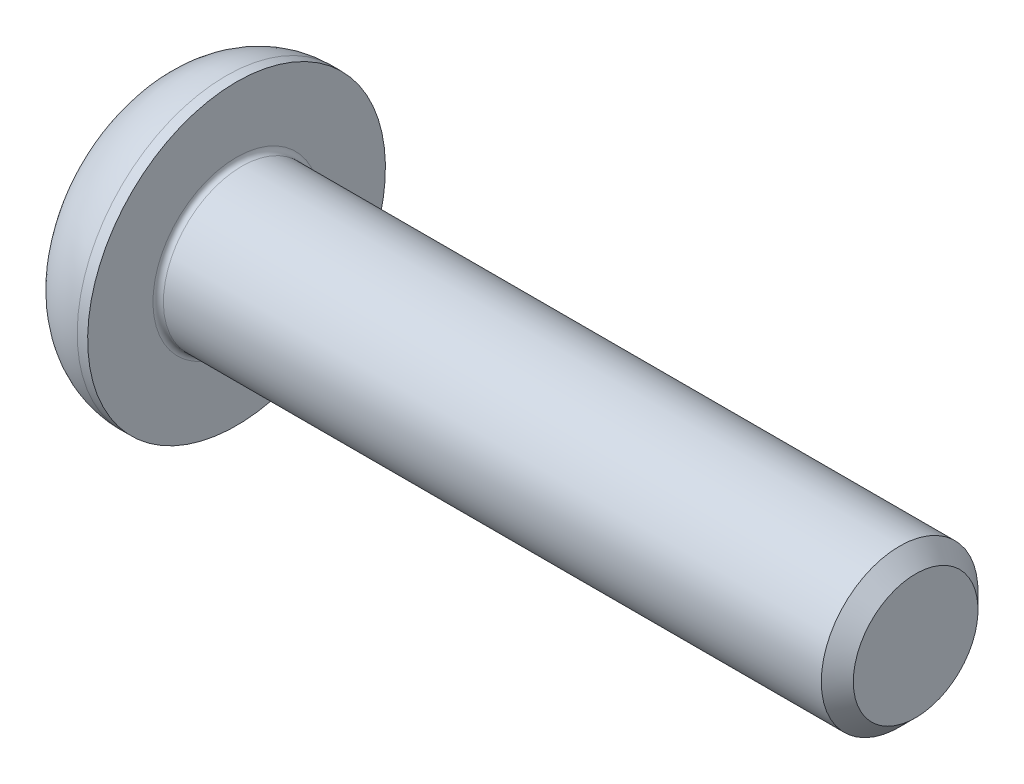
ISO-10303-21;
HEADER;
FILE_DESCRIPTION(('STEP AP214'),'2;1');
FILE_NAME('part.step','',(''),(''),'','','');
FILE_SCHEMA(('AUTOMOTIVE_DESIGN { 1 0 10303 214 1 1 1 1 }'));
ENDSEC;
DATA;
#1=APPLICATION_CONTEXT('core data for automotive mechanical design processes');
#2=APPLICATION_PROTOCOL_DEFINITION('international standard','automotive_design',2000,#1);
#3=PRODUCT_CONTEXT('',#1,'mechanical');
#4=PRODUCT('Part','Part','',(#3));
#5=PRODUCT_RELATED_PRODUCT_CATEGORY('part','',(#4));
#6=PRODUCT_DEFINITION_FORMATION('','',#4);
#7=PRODUCT_DEFINITION_CONTEXT('part definition',#1,'design');
#8=PRODUCT_DEFINITION('design','',#6,#7);
#9=PRODUCT_DEFINITION_SHAPE('','',#8);
#10=(LENGTH_UNIT() NAMED_UNIT(*) SI_UNIT(.MILLI.,.METRE.));
#11=(NAMED_UNIT(*) PLANE_ANGLE_UNIT() SI_UNIT($,.RADIAN.));
#12=(NAMED_UNIT(*) SI_UNIT($,.STERADIAN.) SOLID_ANGLE_UNIT());
#13=UNCERTAINTY_MEASURE_WITH_UNIT(LENGTH_MEASURE(1.E-05),#10,'distance_accuracy_value','');
#14=(GEOMETRIC_REPRESENTATION_CONTEXT(3) GLOBAL_UNCERTAINTY_ASSIGNED_CONTEXT((#13)) GLOBAL_UNIT_ASSIGNED_CONTEXT((#10,
#11,#12)) REPRESENTATION_CONTEXT('',''));
#15=CARTESIAN_POINT('',(0.,0.,0.));
#16=DIRECTION('',(0.,0.,1.));
#17=DIRECTION('',(1.,0.,0.));
#18=AXIS2_PLACEMENT_3D('',#15,#16,#17);
#19=CARTESIAN_POINT('',(-0.613999999927728,0.,0.));
#20=DIRECTION('',(-1.,0.,0.));
#21=DIRECTION('',(0.,0.,1.));
#22=AXIS2_PLACEMENT_3D('',#19,#20,#21);
#23=CONICAL_SURFACE('',#22,1.1616287414995,1.04719755102636);
#24=CARTESIAN_POINT('',(0.0566666667509708,-1.13686837721616E-10,0.));
#25=VERTEX_POINT('',#24);
#26=VERTEX_LOOP('',#25);
#27=FACE_BOUND('',#26,.T.);
#28=CARTESIAN_POINT('',(-0.609999999990473,1.,0.577350269192372));
#29=CARTESIAN_POINT('',(-0.595347772547468,1.,0.526608173647536));
#30=CARTESIAN_POINT('',(-0.582022338528427,1.,0.475428073055482));
#31=CARTESIAN_POINT('',(-0.558763193668327,1.,0.372181722664224));
#32=CARTESIAN_POINT('',(-0.548837710132953,1.,0.320113638974344));
#33=CARTESIAN_POINT('',(-0.533387979430755,1.,0.216622725255095));
#34=CARTESIAN_POINT('',(-0.527760893754125,1.,0.165215814168803));
#35=CARTESIAN_POINT('',(-0.521044584019069,1.,0.0621602316916669));
#36=CARTESIAN_POINT('',(-0.519949796941154,0.999999999999999,0.0105119346228246));
#37=CARTESIAN_POINT('',(-0.522233145033844,0.999999999999999,-0.0859873677504873));
#38=CARTESIAN_POINT('',(-0.525050642566188,0.999999999999999,-0.130852853561466));
#39=CARTESIAN_POINT('',(-0.533978650321297,0.999999999999999,-0.220291541177966));
#40=CARTESIAN_POINT('',(-0.540092207349105,0.999999999999999,-0.264864433869839));
#41=CARTESIAN_POINT('',(-0.55537491663996,0.999999999999999,-0.354487373617652));
#42=CARTESIAN_POINT('',(-0.56460882108348,0.999999999999999,-0.399526083403206));
#43=CARTESIAN_POINT('',(-0.585565880401676,0.999999999999999,-0.488931944904315));
#44=CARTESIAN_POINT('',(-0.59728411436224,0.999999999999999,-0.533300241128735));
#45=CARTESIAN_POINT('',(-0.609999999990474,0.999999999999999,-0.577350269192376));
#46=B_SPLINE_CURVE_WITH_KNOTS('',3,(#28,#29,#30,#31,#32,#33,#34,#35,#36,#37,#38,#39,#40,#41,#42,
#43,#44,#45),.UNSPECIFIED.,.F.,.F.,(4,2,2,2,2,2,2,2,4),(0.,0.158508005788976,0.317396908535048,
0.472353803105483,0.627120444485259,0.761853891346959,0.896712096922982,1.03456081126697,
1.17213898677674),.UNSPECIFIED.);
#47=CARTESIAN_POINT('',(-0.609999999990473,1.00000000000119,0.57735026919031));
#48=VERTEX_POINT('',#47);
#49=CARTESIAN_POINT('',(-0.609999999990077,0.999999999999999,-0.577350269191001));
#50=VERTEX_POINT('',#49);
#51=EDGE_CURVE('E20',#48,#50,#46,.T.);
#52=ORIENTED_EDGE('',*,*,#51,.T.);
#53=CARTESIAN_POINT('',(-0.609999999990473,1.00000000000238,-0.577350269188252));
#54=CARTESIAN_POINT('',(-0.595347772547468,0.956056056219293,-0.60272131696067));
#55=CARTESIAN_POINT('',(-0.582022338528427,0.911732788938332,-0.628311367256697));
#56=CARTESIAN_POINT('',(-0.558763193668327,0.822318826651473,-0.679934542452326));
#57=CARTESIAN_POINT('',(-0.548837710132954,0.777226543449663,-0.705968584297266));
#58=CARTESIAN_POINT('',(-0.533387979430755,0.687600783107929,-0.757714041156891));
#59=CARTESIAN_POINT('',(-0.527760893754125,0.643081092177113,-0.783417496700036));
#60=CARTESIAN_POINT('',(-0.521044584019069,0.55383233975011,-0.834945287938605));
#61=CARTESIAN_POINT('',(-0.519949796941154,0.509103602426288,-0.860769436473026));
#62=CARTESIAN_POINT('',(-0.522233145033844,0.425532755123524,-0.909019087659682));
#63=CARTESIAN_POINT('',(-0.525050642566188,0.386678104658086,-0.931451830565171));
#64=CARTESIAN_POINT('',(-0.533978650321297,0.309221929101056,-0.976171174373421));
#65=CARTESIAN_POINT('',(-0.540092207349105,0.270620671709737,-0.998457620719357));
#66=CARTESIAN_POINT('',(-0.55537491663996,0.193004929126289,-1.04326909059326));
#67=CARTESIAN_POINT('',(-0.56460882108348,0.154000262298324,-1.06578844548604));
#68=CARTESIAN_POINT('',(-0.585565880401676,0.0765725149911307,-1.11049137623659));
#69=CARTESIAN_POINT('',(-0.59728411436224,0.0381484433381501,-1.1326755243488));
#70=CARTESIAN_POINT('',(-0.609999999990473,-2.38028478520414E-12,-1.15470053838063));
#71=B_SPLINE_CURVE_WITH_KNOTS('',3,(#53,#54,#55,#56,#57,#58,#59,#60,#61,#62,#63,#64,#65,#66,#67,
#68,#69,#70),.UNSPECIFIED.,.F.,.F.,(4,2,2,2,2,2,2,2,4),(0.,0.158508005788976,0.317396908535048,
0.472353803105483,0.627120444485259,0.761853891346958,0.896712096922981,1.03456081126696,
1.17213898677673),.UNSPECIFIED.);
#72=CARTESIAN_POINT('',(-0.609999999990473,0.,-1.15470053838063));
#73=VERTEX_POINT('',#72);
#74=EDGE_CURVE('E106',#50,#73,#71,.T.);
#75=ORIENTED_EDGE('',*,*,#74,.T.);
#76=CARTESIAN_POINT('',(-0.609999999990473,2.38084864972529E-12,-1.15470053838062));
#77=CARTESIAN_POINT('',(-0.595347772547468,-0.0439439437807043,-1.12932949060821));
#78=CARTESIAN_POINT('',(-0.582022338528427,-0.0882672110616653,-1.10373944031218));
#79=CARTESIAN_POINT('',(-0.558763193668327,-0.177681173348525,-1.05211626511655));
#80=CARTESIAN_POINT('',(-0.548837710132953,-0.222773456550335,-1.02608222327161));
#81=CARTESIAN_POINT('',(-0.533387979430755,-0.312399216892068,-0.974336766411986));
#82=CARTESIAN_POINT('',(-0.527760893754125,-0.356918907822885,-0.94863331086884));
#83=CARTESIAN_POINT('',(-0.521044584019069,-0.446167660249887,-0.897105519630272));
#84=CARTESIAN_POINT('',(-0.519949796941153,-0.49089639757371,-0.871281371095851));
#85=CARTESIAN_POINT('',(-0.522233145033843,-0.574467244876474,-0.823031719909195));
#86=CARTESIAN_POINT('',(-0.525050642566187,-0.613321895341912,-0.800598977003705));
#87=CARTESIAN_POINT('',(-0.533978650321297,-0.690778070898942,-0.755879633195455));
#88=CARTESIAN_POINT('',(-0.540092207349104,-0.729379328290261,-0.733593186849519));
#89=CARTESIAN_POINT('',(-0.555374916639959,-0.80699507087371,-0.688781716975612));
#90=CARTESIAN_POINT('',(-0.564608821083479,-0.845999737701675,-0.666262362082835));
#91=CARTESIAN_POINT('',(-0.585565880401676,-0.923427485008869,-0.62155943133228));
#92=CARTESIAN_POINT('',(-0.597284114362239,-0.96185155666185,-0.59937528322007));
#93=CARTESIAN_POINT('',(-0.609999999990473,-1.00000000000238,-0.577350269188249));
#94=B_SPLINE_CURVE_WITH_KNOTS('',3,(#76,#77,#78,#79,#80,#81,#82,#83,#84,#85,#86,#87,#88,#89,#90,
#91,#92,#93),.UNSPECIFIED.,.F.,.F.,(4,2,2,2,2,2,2,2,4),(0.,0.158508005788976,0.317396908535047,
0.472353803105483,0.627120444485259,0.761853891346959,0.896712096922982,1.03456081126697,
1.17213898677674),.UNSPECIFIED.);
#95=CARTESIAN_POINT('',(-0.609999999990473,-1.00000000000119,-0.577350269190312));
#96=VERTEX_POINT('',#95);
#97=EDGE_CURVE('E147',#73,#96,#94,.T.);
#98=ORIENTED_EDGE('',*,*,#97,.T.);
#99=CARTESIAN_POINT('',(-0.609999999990473,-1.,-0.577350269192374));
#100=CARTESIAN_POINT('',(-0.595347772547469,-1.,-0.526608173647537));
#101=CARTESIAN_POINT('',(-0.582022338528428,-1.,-0.475428073055484));
#102=CARTESIAN_POINT('',(-0.558763193668328,-1.,-0.372181722664225));
#103=CARTESIAN_POINT('',(-0.548837710132954,-1.,-0.320113638974346));
#104=CARTESIAN_POINT('',(-0.533387979430756,-1.,-0.216622725255096));
#105=CARTESIAN_POINT('',(-0.527760893754126,-1.,-0.165215814168805));
#106=CARTESIAN_POINT('',(-0.52104458401907,-1.,-0.0621602316916682));
#107=CARTESIAN_POINT('',(-0.519949796941154,-1.,-0.0105119346228258));
#108=CARTESIAN_POINT('',(-0.522233145033844,-1.,0.085987367750486));
#109=CARTESIAN_POINT('',(-0.525050642566188,-1.,0.130852853561465));
#110=CARTESIAN_POINT('',(-0.533978650321298,-1.,0.220291541177965));
#111=CARTESIAN_POINT('',(-0.540092207349105,-1.,0.264864433869837));
#112=CARTESIAN_POINT('',(-0.55537491663996,-1.,0.35448737361765));
#113=CARTESIAN_POINT('',(-0.56460882108348,-1.,0.399526083403205));
#114=CARTESIAN_POINT('',(-0.585565880401676,-1.,0.488931944904314));
#115=CARTESIAN_POINT('',(-0.59728411436224,-1.,0.533300241128734));
#116=CARTESIAN_POINT('',(-0.609999999990474,-1.,0.577350269192375));
#117=B_SPLINE_CURVE_WITH_KNOTS('',3,(#99,#100,#101,#102,#103,#104,#105,#106,#107,#108,#109,#110,
#111,#112,#113,#114,#115,#116),.UNSPECIFIED.,.F.,.F.,(4,2,2,2,2,2,2,2,4),(0.,0.158508005788976,
0.317396908535048,0.472353803105483,0.62712044448526,0.761853891346959,0.896712096922982,
1.03456081126697,1.17213898677674),.UNSPECIFIED.);
#118=CARTESIAN_POINT('',(-0.609999999990474,-1.00000000000119,0.577350269190313));
#119=VERTEX_POINT('',#118);
#120=EDGE_CURVE('E169',#96,#119,#117,.T.);
#121=ORIENTED_EDGE('',*,*,#120,.T.);
#122=CARTESIAN_POINT('',(-0.609999999990474,-1.00000000000238,0.577350269188252));
#123=CARTESIAN_POINT('',(-0.595347772547469,-0.956056056219295,0.60272131696067));
#124=CARTESIAN_POINT('',(-0.582022338528428,-0.911732788938334,0.628311367256696));
#125=CARTESIAN_POINT('',(-0.558763193668328,-0.822318826651474,0.679934542452326));
#126=CARTESIAN_POINT('',(-0.548837710132954,-0.777226543449664,0.705968584297266));
#127=CARTESIAN_POINT('',(-0.533387979430756,-0.687600783107931,0.75771404115689));
#128=CARTESIAN_POINT('',(-0.527760893754126,-0.643081092177115,0.783417496700036));
#129=CARTESIAN_POINT('',(-0.52104458401907,-0.553832339750112,0.834945287938604));
#130=CARTESIAN_POINT('',(-0.519949796941154,-0.509103602426289,0.860769436473026));
#131=CARTESIAN_POINT('',(-0.522233145033844,-0.425532755123525,0.909019087659681));
#132=CARTESIAN_POINT('',(-0.525050642566188,-0.386678104658087,0.931451830565171));
#133=CARTESIAN_POINT('',(-0.533978650321298,-0.309221929101058,0.976171174373421));
#134=CARTESIAN_POINT('',(-0.540092207349105,-0.270620671709738,0.998457620719357));
#135=CARTESIAN_POINT('',(-0.55537491663996,-0.19300492912629,1.04326909059326));
#136=CARTESIAN_POINT('',(-0.56460882108348,-0.154000262298325,1.06578844548604));
#137=CARTESIAN_POINT('',(-0.585565880401676,-0.0765725149911316,1.1104913762366));
#138=CARTESIAN_POINT('',(-0.59728411436224,-0.0381484433381508,1.13267552434881));
#139=CARTESIAN_POINT('',(-0.609999999990473,2.37983332056913E-12,1.15470053838063));
#140=B_SPLINE_CURVE_WITH_KNOTS('',3,(#122,#123,#124,#125,#126,#127,#128,#129,#130,#131,#132,
#133,#134,#135,#136,#137,#138,#139),.UNSPECIFIED.,.F.,.F.,(4,2,2,2,2,2,2,2,4),(0.,
0.158508005788976,0.317396908535048,0.472353803105484,0.62712044448526,0.761853891346959,
0.896712096922982,1.03456081126697,1.17213898677674),.UNSPECIFIED.);
#141=CARTESIAN_POINT('',(-0.609999999990473,0.,1.15470053838063));
#142=VERTEX_POINT('',#141);
#143=EDGE_CURVE('E174',#119,#142,#140,.T.);
#144=ORIENTED_EDGE('',*,*,#143,.T.);
#145=CARTESIAN_POINT('',(-0.609999999990473,-2.38133570472571E-12,1.15470053838062));
#146=CARTESIAN_POINT('',(-0.595347772547468,0.0439439437807039,1.12932949060821));
#147=CARTESIAN_POINT('',(-0.582022338528427,0.0882672110616649,1.10373944031218));
#148=CARTESIAN_POINT('',(-0.558763193668327,0.177681173348524,1.05211626511655));
#149=CARTESIAN_POINT('',(-0.548837710132953,0.222773456550334,1.02608222327161));
#150=CARTESIAN_POINT('',(-0.533387979430755,0.312399216892067,0.974336766411986));
#151=CARTESIAN_POINT('',(-0.527760893754125,0.356918907822884,0.94863331086884));
#152=CARTESIAN_POINT('',(-0.521044584019069,0.446167660249886,0.897105519630272));
#153=CARTESIAN_POINT('',(-0.519949796941153,0.490896397573709,0.871281371095851));
#154=CARTESIAN_POINT('',(-0.522233145033842,0.574467244876473,0.823031719909194));
#155=CARTESIAN_POINT('',(-0.525050642566187,0.613321895341912,0.800598977003705));
#156=CARTESIAN_POINT('',(-0.533978650321296,0.690778070898941,0.755879633195455));
#157=CARTESIAN_POINT('',(-0.540092207349104,0.729379328290261,0.733593186849518));
#158=CARTESIAN_POINT('',(-0.555374916639959,0.80699507087371,0.688781716975611));
#159=CARTESIAN_POINT('',(-0.564608821083479,0.845999737701675,0.666262362082834));
#160=CARTESIAN_POINT('',(-0.585565880401675,0.923427485008869,0.621559431332279));
#161=CARTESIAN_POINT('',(-0.597284114362239,0.96185155666185,0.599375283220069));
#162=CARTESIAN_POINT('',(-0.609999999990473,1.00000000000238,0.577350269188248));
#163=B_SPLINE_CURVE_WITH_KNOTS('',3,(#145,#146,#147,#148,#149,#150,#151,#152,#153,#154,#155,
#156,#157,#158,#159,#160,#161,#162),.UNSPECIFIED.,.F.,.F.,(4,2,2,2,2,2,2,2,4),(0.,
0.158508005788976,0.317396908535048,0.472353803105483,0.627120444485259,0.761853891346959,
0.896712096922983,1.03456081126697,1.17213898677674),.UNSPECIFIED.);
#164=EDGE_CURVE('E92',#142,#48,#163,.T.);
#165=ORIENTED_EDGE('',*,*,#164,.T.);
#166=EDGE_LOOP('',(#52,#75,#98,#121,#144,#165));
#167=FACE_BOUND('',#166,.T.);
#168=ADVANCED_FACE('F16',(#27,#167),#23,.F.);
#169=CARTESIAN_POINT('',(-1.65,1.,0.577350269189624));
#170=DIRECTION('',(0.,1.,0.));
#171=DIRECTION('',(0.,0.,1.));
#172=AXIS2_PLACEMENT_3D('',#169,#170,#171);
#173=PLANE('',#172);
#174=DIRECTION('',(1.,0.,0.));
#175=VECTOR('',#174,1.);
#176=CARTESIAN_POINT('',(-1.65,1.,0.577350269189623));
#177=LINE('',#176,#175);
#178=CARTESIAN_POINT('',(-1.65,0.999999999999999,0.577350269189624));
#179=VERTEX_POINT('',#178);
#180=EDGE_CURVE('E87',#48,#179,#177,.F.);
#181=ORIENTED_EDGE('',*,*,#180,.T.);
#182=DIRECTION('',(0.,0.,1.));
#183=VECTOR('',#182,1.);
#184=CARTESIAN_POINT('',(-1.65,0.999999999999999,0.));
#185=LINE('',#184,#183);
#186=CARTESIAN_POINT('',(-1.65,0.999999999999999,-0.577350269189626));
#187=VERTEX_POINT('',#186);
#188=EDGE_CURVE('E90',#187,#179,#185,.T.);
#189=ORIENTED_EDGE('',*,*,#188,.F.);
#190=DIRECTION('',(1.,0.,0.));
#191=VECTOR('',#190,1.);
#192=CARTESIAN_POINT('',(-1.65,0.999999999999999,-0.577350269189626));
#193=LINE('',#192,#191);
#194=EDGE_CURVE('E109',#187,#50,#193,.T.);
#195=ORIENTED_EDGE('',*,*,#194,.T.);
#196=ORIENTED_EDGE('',*,*,#51,.F.);
#197=EDGE_LOOP('',(#181,#189,#195,#196));
#198=FACE_BOUND('',#197,.T.);
#199=ADVANCED_FACE('F88',(#198),#173,.F.);
#200=CARTESIAN_POINT('',(-1.65,0.,1.15470053837925));
#201=DIRECTION('',(0.,0.500000000000001,0.866025403784438));
#202=DIRECTION('',(0.,-0.866025403784438,0.500000000000001));
#203=AXIS2_PLACEMENT_3D('',#200,#201,#202);
#204=PLANE('',#203);
#205=DIRECTION('',(1.,0.,0.));
#206=VECTOR('',#205,1.);
#207=CARTESIAN_POINT('',(-1.65,0.,1.15470053837925));
#208=LINE('',#207,#206);
#209=CARTESIAN_POINT('',(-1.65,0.,1.15470053837925));
#210=VERTEX_POINT('',#209);
#211=EDGE_CURVE('E84',#142,#210,#208,.F.);
#212=ORIENTED_EDGE('',*,*,#211,.T.);
#213=DIRECTION('',(0.,-0.866025403784439,0.5));
#214=VECTOR('',#213,1.);
#215=CARTESIAN_POINT('',(-1.65,1.,0.577350269189624));
#216=LINE('',#215,#214);
#217=EDGE_CURVE('E95',#179,#210,#216,.T.);
#218=ORIENTED_EDGE('',*,*,#217,.F.);
#219=ORIENTED_EDGE('',*,*,#180,.F.);
#220=ORIENTED_EDGE('',*,*,#164,.F.);
#221=EDGE_LOOP('',(#212,#218,#219,#220));
#222=FACE_BOUND('',#221,.T.);
#223=ADVANCED_FACE('F96',(#222),#204,.F.);
#224=CARTESIAN_POINT('',(-1.65,-1.,0.577350269189626));
#225=DIRECTION('',(0.,-0.5,0.866025403784439));
#226=DIRECTION('',(0.,-0.866025403784439,-0.5));
#227=AXIS2_PLACEMENT_3D('',#224,#225,#226);
#228=PLANE('',#227);
#229=DIRECTION('',(1.,0.,0.));
#230=VECTOR('',#229,1.);
#231=CARTESIAN_POINT('',(-1.65,-1.,0.577350269189626));
#232=LINE('',#231,#230);
#233=CARTESIAN_POINT('',(-1.65,-1.,0.577350269189626));
#234=VERTEX_POINT('',#233);
#235=EDGE_CURVE('E180',#119,#234,#232,.F.);
#236=ORIENTED_EDGE('',*,*,#235,.T.);
#237=DIRECTION('',(0.,-0.866025403784439,-0.499999999999999));
#238=VECTOR('',#237,1.);
#239=CARTESIAN_POINT('',(-1.65,0.,1.15470053837925));
#240=LINE('',#239,#238);
#241=EDGE_CURVE('E99',#210,#234,#240,.T.);
#242=ORIENTED_EDGE('',*,*,#241,.F.);
#243=ORIENTED_EDGE('',*,*,#211,.F.);
#244=ORIENTED_EDGE('',*,*,#143,.F.);
#245=EDGE_LOOP('',(#236,#242,#243,#244));
#246=FACE_BOUND('',#245,.T.);
#247=ADVANCED_FACE('F181',(#246),#228,.F.);
#248=CARTESIAN_POINT('',(-1.65,-1.,-0.577350269189625));
#249=DIRECTION('',(0.,-1.,0.));
#250=DIRECTION('',(1.,0.,0.));
#251=AXIS2_PLACEMENT_3D('',#248,#249,#250);
#252=PLANE('',#251);
#253=DIRECTION('',(1.,0.,0.));
#254=VECTOR('',#253,1.);
#255=CARTESIAN_POINT('',(-1.65,-1.,-0.577350269189624));
#256=LINE('',#255,#254);
#257=CARTESIAN_POINT('',(-1.65,-1.,-0.577350269189624));
#258=VERTEX_POINT('',#257);
#259=EDGE_CURVE('E258',#96,#258,#256,.F.);
#260=ORIENTED_EDGE('',*,*,#259,.T.);
#261=DIRECTION('',(0.,0.,1.));
#262=VECTOR('',#261,1.);
#263=CARTESIAN_POINT('',(-1.65,-1.,0.));
#264=LINE('',#263,#262);
#265=EDGE_CURVE('E121',#234,#258,#264,.F.);
#266=ORIENTED_EDGE('',*,*,#265,.F.);
#267=ORIENTED_EDGE('',*,*,#235,.F.);
#268=ORIENTED_EDGE('',*,*,#120,.F.);
#269=EDGE_LOOP('',(#260,#266,#267,#268));
#270=FACE_BOUND('',#269,.T.);
#271=ADVANCED_FACE('F184',(#270),#252,.F.);
#272=CARTESIAN_POINT('',(-1.65,0.,-1.15470053837925));
#273=DIRECTION('',(0.,-0.5,-0.866025403784438));
#274=DIRECTION('',(0.,0.866025403784438,-0.5));
#275=AXIS2_PLACEMENT_3D('',#272,#273,#274);
#276=PLANE('',#275);
#277=DIRECTION('',(1.,0.,0.));
#278=VECTOR('',#277,1.);
#279=CARTESIAN_POINT('',(-1.65,0.,-1.15470053837925));
#280=LINE('',#279,#278);
#281=CARTESIAN_POINT('',(-1.65,0.,-1.15470053837925));
#282=VERTEX_POINT('',#281);
#283=EDGE_CURVE('E252',#73,#282,#280,.F.);
#284=ORIENTED_EDGE('',*,*,#283,.T.);
#285=DIRECTION('',(0.,0.866025403784439,-0.5));
#286=VECTOR('',#285,1.);
#287=CARTESIAN_POINT('',(-1.65,-1.,-0.577350269189625));
#288=LINE('',#287,#286);
#289=EDGE_CURVE('E117',#258,#282,#288,.T.);
#290=ORIENTED_EDGE('',*,*,#289,.F.);
#291=ORIENTED_EDGE('',*,*,#259,.F.);
#292=ORIENTED_EDGE('',*,*,#97,.F.);
#293=EDGE_LOOP('',(#284,#290,#291,#292));
#294=FACE_BOUND('',#293,.T.);
#295=ADVANCED_FACE('F276',(#294),#276,.F.);
#296=CARTESIAN_POINT('',(-1.65,0.999999999999999,-0.577350269189626));
#297=DIRECTION('',(0.,0.5,-0.866025403784439));
#298=DIRECTION('',(0.,0.866025403784439,0.5));
#299=AXIS2_PLACEMENT_3D('',#296,#297,#298);
#300=PLANE('',#299);
#301=ORIENTED_EDGE('',*,*,#194,.F.);
#302=DIRECTION('',(0.,0.866025403784439,0.499999999999999));
#303=VECTOR('',#302,1.);
#304=CARTESIAN_POINT('',(-1.65,0.,-1.15470053837925));
#305=LINE('',#304,#303);
#306=EDGE_CURVE('E105',#282,#187,#305,.T.);
#307=ORIENTED_EDGE('',*,*,#306,.F.);
#308=ORIENTED_EDGE('',*,*,#283,.F.);
#309=ORIENTED_EDGE('',*,*,#74,.F.);
#310=EDGE_LOOP('',(#301,#307,#308,#309));
#311=FACE_BOUND('',#310,.T.);
#312=ADVANCED_FACE('F153',(#311),#300,.F.);
#313=CARTESIAN_POINT('',(-1.65,2.00235026918963,0.));
#314=DIRECTION('',(-1.,0.,0.));
#315=DIRECTION('',(0.,-1.,0.));
#316=AXIS2_PLACEMENT_3D('',#313,#314,#315);
#317=PLANE('',#316);
#318=ORIENTED_EDGE('',*,*,#289,.T.);
#319=ORIENTED_EDGE('',*,*,#306,.T.);
#320=ORIENTED_EDGE('',*,*,#188,.T.);
#321=ORIENTED_EDGE('',*,*,#217,.T.);
#322=ORIENTED_EDGE('',*,*,#241,.T.);
#323=ORIENTED_EDGE('',*,*,#265,.T.);
#324=EDGE_LOOP('',(#318,#319,#320,#321,#322,#323));
#325=FACE_BOUND('',#324,.T.);
#326=CARTESIAN_POINT('',(-1.65,0.,1.4));
#327=CARTESIAN_POINT('',(-1.65,0.266773210618221,1.4));
#328=CARTESIAN_POINT('',(-1.65,0.515332593386623,1.3017036214874));
#329=CARTESIAN_POINT('',(-1.65,0.784472673853909,1.19526831042464));
#330=CARTESIAN_POINT('',(-1.65,0.989949493661167,0.989949493661166));
#331=CARTESIAN_POINT('',(-1.65,1.1946808366046,0.785375580521126));
#332=CARTESIAN_POINT('',(-1.65,1.3017036214874,0.515332593386622));
#333=CARTESIAN_POINT('',(-1.65,1.4,0.267308327272514));
#334=CARTESIAN_POINT('',(-1.65,1.4,0.));
#335=B_SPLINE_CURVE_WITH_KNOTS('',2,(#326,#327,#328,#329,#330,#331,#332,#333,#334),
.UNSPECIFIED.,.F.,.F.,(3,2,2,2,3),(0.,0.25,0.5,0.75,1.),.UNSPECIFIED.);
#336=CARTESIAN_POINT('',(-1.65,0.,1.4));
#337=VERTEX_POINT('',#336);
#338=CARTESIAN_POINT('',(-1.65,1.4,0.));
#339=VERTEX_POINT('',#338);
#340=EDGE_CURVE('E38',#337,#339,#335,.T.);
#341=ORIENTED_EDGE('',*,*,#340,.T.);
#342=CARTESIAN_POINT('',(-1.65,0.,0.));
#343=DIRECTION('',(1.,0.,0.));
#344=DIRECTION('',(0.,1.,0.));
#345=AXIS2_PLACEMENT_3D('',#342,#343,#344);
#346=CIRCLE('',#345,1.4);
#347=EDGE_CURVE('E141',#339,#337,#346,.F.);
#348=ORIENTED_EDGE('',*,*,#347,.T.);
#349=EDGE_LOOP('',(#341,#348));
#350=FACE_BOUND('',#349,.T.);
#351=ADVANCED_FACE('F103',(#325,#350),#317,.T.);
#352=CARTESIAN_POINT('',(-0.199999999999997,0.,0.));
#353=DIRECTION('',(1.,0.,0.));
#354=DIRECTION('',(0.,1.,0.));
#355=AXIS2_PLACEMENT_3D('',#352,#353,#354);
#356=DEGENERATE_TOROIDAL_SURFACE('',#355,1.4,1.45,.T.);
#357=ORIENTED_EDGE('',*,*,#340,.F.);
#358=ORIENTED_EDGE('',*,*,#347,.F.);
#359=EDGE_LOOP('',(#357,#358));
#360=FACE_BOUND('',#359,.T.);
#361=CARTESIAN_POINT('',(-0.199999999999996,0.,0.));
#362=DIRECTION('',(1.,0.,0.));
#363=DIRECTION('',(0.,1.,0.));
#364=AXIS2_PLACEMENT_3D('',#361,#362,#363);
#365=CIRCLE('',#364,2.85);
#366=CARTESIAN_POINT('',(-0.199999999999996,2.85,0.));
#367=VERTEX_POINT('',#366);
#368=EDGE_CURVE('E140',#367,#367,#365,.T.);
#369=ORIENTED_EDGE('',*,*,#368,.F.);
#370=EDGE_LOOP('',(#369));
#371=FACE_BOUND('',#370,.T.);
#372=ADVANCED_FACE('F18',(#360,#371),#356,.T.);
#373=CARTESIAN_POINT('',(-0.824999999999996,0.,0.));
#374=DIRECTION('',(1.,0.,0.));
#375=DIRECTION('',(0.,1.,0.));
#376=AXIS2_PLACEMENT_3D('',#373,#374,#375);
#377=CYLINDRICAL_SURFACE('',#376,2.85);
#378=ORIENTED_EDGE('',*,*,#368,.T.);
#379=EDGE_LOOP('',(#378));
#380=FACE_BOUND('',#379,.T.);
#381=CARTESIAN_POINT('',(0.,0.,0.));
#382=DIRECTION('',(1.,0.,0.));
#383=DIRECTION('',(0.,1.,0.));
#384=AXIS2_PLACEMENT_3D('',#381,#382,#383);
#385=CIRCLE('',#384,2.85);
#386=CARTESIAN_POINT('',(0.,2.85,0.));
#387=VERTEX_POINT('',#386);
#388=EDGE_CURVE('E137',#387,#387,#385,.T.);
#389=ORIENTED_EDGE('',*,*,#388,.F.);
#390=EDGE_LOOP('',(#389));
#391=FACE_BOUND('',#390,.T.);
#392=ADVANCED_FACE('F235',(#380,#391),#377,.T.);
#393=CARTESIAN_POINT('',(0.,2.175,0.));
#394=DIRECTION('',(1.,0.,0.));
#395=DIRECTION('',(0.,1.,0.));
#396=AXIS2_PLACEMENT_3D('',#393,#394,#395);
#397=PLANE('',#396);
#398=CARTESIAN_POINT('',(0.,0.,0.));
#399=DIRECTION('',(1.,0.,0.));
#400=DIRECTION('',(0.,1.,0.));
#401=AXIS2_PLACEMENT_3D('',#398,#399,#400);
#402=CIRCLE('',#401,1.6);
#403=CARTESIAN_POINT('',(0.,1.6,0.));
#404=VERTEX_POINT('',#403);
#405=EDGE_CURVE('E136',#404,#404,#402,.F.);
#406=ORIENTED_EDGE('',*,*,#405,.T.);
#407=EDGE_LOOP('',(#406));
#408=FACE_BOUND('',#407,.T.);
#409=ORIENTED_EDGE('',*,*,#388,.T.);
#410=EDGE_LOOP('',(#409));
#411=FACE_BOUND('',#410,.T.);
#412=ADVANCED_FACE('F226',(#408,#411),#397,.T.);
#413=CARTESIAN_POINT('',(13.0000034595889,0.75,0.));
#414=DIRECTION('',(1.,0.,0.));
#415=DIRECTION('',(0.,1.,0.));
#416=AXIS2_PLACEMENT_3D('',#413,#414,#415);
#417=PLANE('',#416);
#418=CARTESIAN_POINT('',(13.000003459581,0.,0.));
#419=DIRECTION('',(-1.,0.,0.));
#420=DIRECTION('',(0.,0.,1.));
#421=AXIS2_PLACEMENT_3D('',#418,#419,#420);
#422=CIRCLE('',#421,1.19327499999144);
#423=CARTESIAN_POINT('',(13.000003459581,0.,1.19327499999144));
#424=VERTEX_POINT('',#423);
#425=EDGE_CURVE('E133',#424,#424,#422,.T.);
#426=ORIENTED_EDGE('',*,*,#425,.F.);
#427=EDGE_LOOP('',(#426));
#428=FACE_BOUND('',#427,.T.);
#429=ADVANCED_FACE('F210',(#428),#417,.T.);
#430=CARTESIAN_POINT('',(0.100000000000002,0.,0.));
#431=DIRECTION('',(1.,0.,0.));
#432=DIRECTION('',(0.,0.,-1.));
#433=AXIS2_PLACEMENT_3D('',#430,#431,#432);
#434=TOROIDAL_SURFACE('',#433,1.6,0.1);
#435=CARTESIAN_POINT('',(0.100000000000002,0.,0.));
#436=DIRECTION('',(1.,0.,0.));
#437=DIRECTION('',(0.,1.,0.));
#438=AXIS2_PLACEMENT_3D('',#435,#436,#437);
#439=CIRCLE('',#438,1.5);
#440=CARTESIAN_POINT('',(0.100000000000002,1.5,0.));
#441=VERTEX_POINT('',#440);
#442=EDGE_CURVE('E30',#441,#441,#439,.T.);
#443=ORIENTED_EDGE('',*,*,#442,.F.);
#444=EDGE_LOOP('',(#443));
#445=FACE_BOUND('',#444,.T.);
#446=ORIENTED_EDGE('',*,*,#405,.F.);
#447=EDGE_LOOP('',(#446));
#448=FACE_BOUND('',#447,.T.);
#449=ADVANCED_FACE('F201',(#445,#448),#434,.F.);
#450=CARTESIAN_POINT('',(12.693278459551,0.,0.));
#451=DIRECTION('',(-1.,0.,0.));
#452=DIRECTION('',(0.,0.,1.));
#453=AXIS2_PLACEMENT_3D('',#450,#451,#452);
#454=CONICAL_SURFACE('',#453,1.50000000002137,0.785398163397448);
#455=ORIENTED_EDGE('',*,*,#425,.T.);
#456=EDGE_LOOP('',(#455));
#457=FACE_BOUND('',#456,.T.);
#458=CARTESIAN_POINT('',(12.6932784595889,0.,0.));
#459=DIRECTION('',(1.,0.,0.));
#460=DIRECTION('',(0.,1.,0.));
#461=AXIS2_PLACEMENT_3D('',#458,#459,#460);
#462=CIRCLE('',#461,1.5);
#463=CARTESIAN_POINT('',(12.6932784595889,1.5,0.));
#464=VERTEX_POINT('',#463);
#465=EDGE_CURVE('E11',#464,#464,#462,.F.);
#466=ORIENTED_EDGE('',*,*,#465,.F.);
#467=EDGE_LOOP('',(#466));
#468=FACE_BOUND('',#467,.T.);
#469=ADVANCED_FACE('F195',(#457,#468),#454,.T.);
#470=CARTESIAN_POINT('',(6.5,0.,0.));
#471=DIRECTION('',(1.,0.,0.));
#472=DIRECTION('',(0.,1.,0.));
#473=AXIS2_PLACEMENT_3D('',#470,#471,#472);
#474=CYLINDRICAL_SURFACE('',#473,1.5);
#475=ORIENTED_EDGE('',*,*,#465,.T.);
#476=EDGE_LOOP('',(#475));
#477=FACE_BOUND('',#476,.T.);
#478=ORIENTED_EDGE('',*,*,#442,.T.);
#479=EDGE_LOOP('',(#478));
#480=FACE_BOUND('',#479,.T.);
#481=ADVANCED_FACE('F193',(#477,#480),#474,.T.);
#482=CLOSED_SHELL('',(#168,#199,#223,#247,#271,#295,#312,#351,#372,#392,#412,#429,#449,#469,#481));
#483=MANIFOLD_SOLID_BREP('B1',#482);
#484=ADVANCED_BREP_SHAPE_REPRESENTATION('',(#18,#483),#14);
#485=SHAPE_DEFINITION_REPRESENTATION(#9,#484);
ENDSEC;
END-ISO-10303-21;
